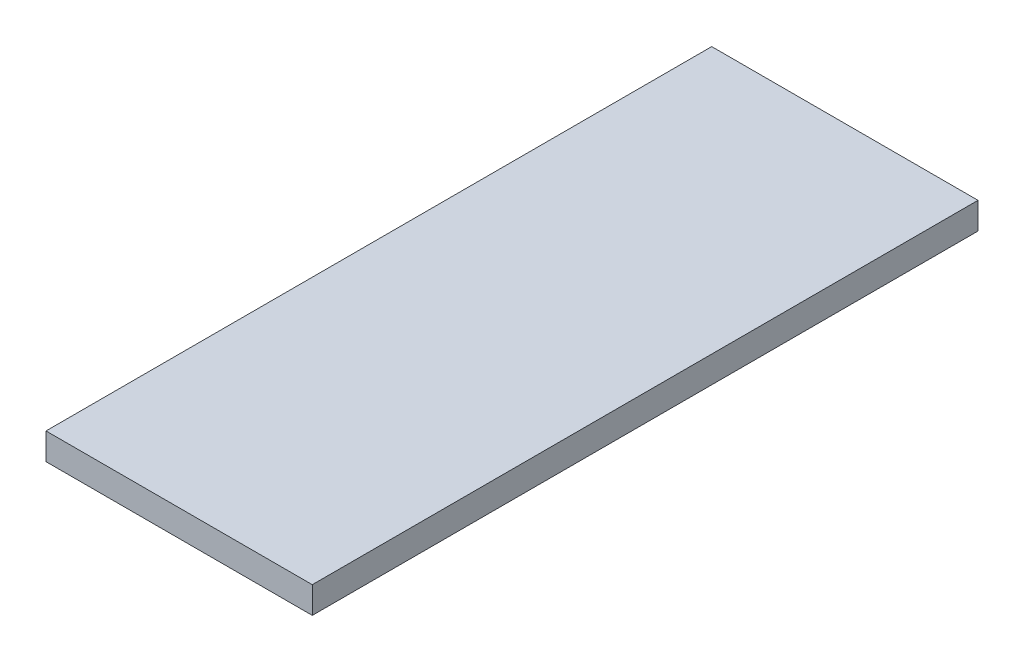
ISO-10303-21;
HEADER;
FILE_DESCRIPTION(('STEP AP214'),'2;1');
FILE_NAME('part.step','',(''),(''),'','','');
FILE_SCHEMA(('AUTOMOTIVE_DESIGN { 1 0 10303 214 1 1 1 1 }'));
ENDSEC;
DATA;
#1=APPLICATION_CONTEXT('core data for automotive mechanical design processes');
#2=APPLICATION_PROTOCOL_DEFINITION('international standard','automotive_design',2000,#1);
#3=PRODUCT_CONTEXT('',#1,'mechanical');
#4=PRODUCT('Part','Part','',(#3));
#5=PRODUCT_RELATED_PRODUCT_CATEGORY('part','',(#4));
#6=PRODUCT_DEFINITION_FORMATION('','',#4);
#7=PRODUCT_DEFINITION_CONTEXT('part definition',#1,'design');
#8=PRODUCT_DEFINITION('design','',#6,#7);
#9=PRODUCT_DEFINITION_SHAPE('','',#8);
#10=(LENGTH_UNIT() NAMED_UNIT(*) SI_UNIT(.MILLI.,.METRE.));
#11=(NAMED_UNIT(*) PLANE_ANGLE_UNIT() SI_UNIT($,.RADIAN.));
#12=(NAMED_UNIT(*) SI_UNIT($,.STERADIAN.) SOLID_ANGLE_UNIT());
#13=UNCERTAINTY_MEASURE_WITH_UNIT(LENGTH_MEASURE(1.E-05),#10,'distance_accuracy_value','');
#14=(GEOMETRIC_REPRESENTATION_CONTEXT(3) GLOBAL_UNCERTAINTY_ASSIGNED_CONTEXT((#13)) GLOBAL_UNIT_ASSIGNED_CONTEXT((#10,
#11,#12)) REPRESENTATION_CONTEXT('',''));
#15=CARTESIAN_POINT('',(0.,0.,0.));
#16=DIRECTION('',(0.,0.,1.));
#17=DIRECTION('',(1.,0.,0.));
#18=AXIS2_PLACEMENT_3D('',#15,#16,#17);
#19=CARTESIAN_POINT('',(0.,4.,0.));
#20=DIRECTION('',(1.,0.,0.));
#21=DIRECTION('',(0.,0.,-1.));
#22=AXIS2_PLACEMENT_3D('',#19,#20,#21);
#23=PLANE('',#22);
#24=DIRECTION('',(0.,0.,1.));
#25=VECTOR('',#24,1.);
#26=CARTESIAN_POINT('',(0.,0.,0.));
#27=LINE('',#26,#25);
#28=CARTESIAN_POINT('',(0.,0.,0.));
#29=VERTEX_POINT('',#28);
#30=CARTESIAN_POINT('',(0.,0.,100.));
#31=VERTEX_POINT('',#30);
#32=EDGE_CURVE('E107',#29,#31,#27,.T.);
#33=ORIENTED_EDGE('',*,*,#32,.T.);
#34=DIRECTION('',(0.,-1.,0.));
#35=VECTOR('',#34,1.);
#36=CARTESIAN_POINT('',(0.,4.,100.));
#37=LINE('',#36,#35);
#38=CARTESIAN_POINT('',(0.,4.,100.));
#39=VERTEX_POINT('',#38);
#40=EDGE_CURVE('E11',#39,#31,#37,.T.);
#41=ORIENTED_EDGE('',*,*,#40,.F.);
#42=DIRECTION('',(0.,0.,1.));
#43=VECTOR('',#42,1.);
#44=CARTESIAN_POINT('',(0.,4.,0.));
#45=LINE('',#44,#43);
#46=CARTESIAN_POINT('',(0.,4.,0.));
#47=VERTEX_POINT('',#46);
#48=EDGE_CURVE('E91',#47,#39,#45,.T.);
#49=ORIENTED_EDGE('',*,*,#48,.F.);
#50=DIRECTION('',(0.,-1.,0.));
#51=VECTOR('',#50,1.);
#52=CARTESIAN_POINT('',(0.,4.,0.));
#53=LINE('',#52,#51);
#54=EDGE_CURVE('E103',#47,#29,#53,.T.);
#55=ORIENTED_EDGE('',*,*,#54,.T.);
#56=EDGE_LOOP('',(#33,#41,#49,#55));
#57=FACE_BOUND('',#56,.T.);
#58=ADVANCED_FACE('F39',(#57),#23,.F.);
#59=CARTESIAN_POINT('',(0.,4.,100.));
#60=DIRECTION('',(0.,0.,-1.));
#61=DIRECTION('',(-1.,0.,0.));
#62=AXIS2_PLACEMENT_3D('',#59,#60,#61);
#63=PLANE('',#62);
#64=DIRECTION('',(1.,0.,0.));
#65=VECTOR('',#64,1.);
#66=CARTESIAN_POINT('',(0.,0.,100.));
#67=LINE('',#66,#65);
#68=CARTESIAN_POINT('',(40.,0.,100.));
#69=VERTEX_POINT('',#68);
#70=EDGE_CURVE('E96',#31,#69,#67,.T.);
#71=ORIENTED_EDGE('',*,*,#70,.T.);
#72=DIRECTION('',(0.,-1.,0.));
#73=VECTOR('',#72,1.);
#74=CARTESIAN_POINT('',(40.,4.,100.));
#75=LINE('',#74,#73);
#76=CARTESIAN_POINT('',(40.,4.,100.));
#77=VERTEX_POINT('',#76);
#78=EDGE_CURVE('E48',#77,#69,#75,.T.);
#79=ORIENTED_EDGE('',*,*,#78,.F.);
#80=DIRECTION('',(1.,0.,0.));
#81=VECTOR('',#80,1.);
#82=CARTESIAN_POINT('',(0.,4.,100.));
#83=LINE('',#82,#81);
#84=EDGE_CURVE('E86',#39,#77,#83,.T.);
#85=ORIENTED_EDGE('',*,*,#84,.F.);
#86=ORIENTED_EDGE('',*,*,#40,.T.);
#87=EDGE_LOOP('',(#71,#79,#85,#86));
#88=FACE_BOUND('',#87,.T.);
#89=ADVANCED_FACE('F95',(#88),#63,.F.);
#90=CARTESIAN_POINT('',(40.,4.,0.));
#91=DIRECTION('',(-1.,0.,0.));
#92=DIRECTION('',(0.,0.,1.));
#93=AXIS2_PLACEMENT_3D('',#90,#91,#92);
#94=PLANE('',#93);
#95=DIRECTION('',(0.,0.,-1.));
#96=VECTOR('',#95,1.);
#97=CARTESIAN_POINT('',(40.,0.,0.));
#98=LINE('',#97,#96);
#99=CARTESIAN_POINT('',(40.,0.,0.));
#100=VERTEX_POINT('',#99);
#101=EDGE_CURVE('E73',#69,#100,#98,.T.);
#102=ORIENTED_EDGE('',*,*,#101,.T.);
#103=DIRECTION('',(0.,-1.,0.));
#104=VECTOR('',#103,1.);
#105=CARTESIAN_POINT('',(40.,4.,0.));
#106=LINE('',#105,#104);
#107=CARTESIAN_POINT('',(40.,4.,0.));
#108=VERTEX_POINT('',#107);
#109=EDGE_CURVE('E98',#108,#100,#106,.T.);
#110=ORIENTED_EDGE('',*,*,#109,.F.);
#111=DIRECTION('',(0.,0.,-1.));
#112=VECTOR('',#111,1.);
#113=CARTESIAN_POINT('',(40.,4.,0.));
#114=LINE('',#113,#112);
#115=EDGE_CURVE('E89',#77,#108,#114,.T.);
#116=ORIENTED_EDGE('',*,*,#115,.F.);
#117=ORIENTED_EDGE('',*,*,#78,.T.);
#118=EDGE_LOOP('',(#102,#110,#116,#117));
#119=FACE_BOUND('',#118,.T.);
#120=ADVANCED_FACE('F99',(#119),#94,.F.);
#121=CARTESIAN_POINT('',(0.,4.,0.));
#122=DIRECTION('',(0.,0.,1.));
#123=DIRECTION('',(1.,0.,0.));
#124=AXIS2_PLACEMENT_3D('',#121,#122,#123);
#125=PLANE('',#124);
#126=DIRECTION('',(-1.,0.,0.));
#127=VECTOR('',#126,1.);
#128=CARTESIAN_POINT('',(0.,0.,0.));
#129=LINE('',#128,#127);
#130=EDGE_CURVE('E79',#100,#29,#129,.T.);
#131=ORIENTED_EDGE('',*,*,#130,.T.);
#132=ORIENTED_EDGE('',*,*,#54,.F.);
#133=DIRECTION('',(-1.,0.,0.));
#134=VECTOR('',#133,1.);
#135=CARTESIAN_POINT('',(0.,4.,0.));
#136=LINE('',#135,#134);
#137=EDGE_CURVE('E56',#108,#47,#136,.T.);
#138=ORIENTED_EDGE('',*,*,#137,.F.);
#139=ORIENTED_EDGE('',*,*,#109,.T.);
#140=EDGE_LOOP('',(#131,#132,#138,#139));
#141=FACE_BOUND('',#140,.T.);
#142=ADVANCED_FACE('F120',(#141),#125,.F.);
#143=CARTESIAN_POINT('',(0.,4.,0.));
#144=DIRECTION('',(0.,1.,0.));
#145=DIRECTION('',(0.,0.,1.));
#146=AXIS2_PLACEMENT_3D('',#143,#144,#145);
#147=PLANE('',#146);
#148=ORIENTED_EDGE('',*,*,#48,.T.);
#149=ORIENTED_EDGE('',*,*,#84,.T.);
#150=ORIENTED_EDGE('',*,*,#115,.T.);
#151=ORIENTED_EDGE('',*,*,#137,.T.);
#152=EDGE_LOOP('',(#148,#149,#150,#151));
#153=FACE_BOUND('',#152,.T.);
#154=ADVANCED_FACE('F87',(#153),#147,.T.);
#155=CARTESIAN_POINT('',(0.,0.,0.));
#156=DIRECTION('',(0.,1.,0.));
#157=DIRECTION('',(0.,0.,1.));
#158=AXIS2_PLACEMENT_3D('',#155,#156,#157);
#159=PLANE('',#158);
#160=ORIENTED_EDGE('',*,*,#32,.F.);
#161=ORIENTED_EDGE('',*,*,#130,.F.);
#162=ORIENTED_EDGE('',*,*,#101,.F.);
#163=ORIENTED_EDGE('',*,*,#70,.F.);
#164=EDGE_LOOP('',(#160,#161,#162,#163));
#165=FACE_BOUND('',#164,.T.);
#166=ADVANCED_FACE('F123',(#165),#159,.F.);
#167=CLOSED_SHELL('',(#58,#89,#120,#142,#154,#166));
#168=MANIFOLD_SOLID_BREP('B2',#167);
#169=ADVANCED_BREP_SHAPE_REPRESENTATION('',(#18,#168),#14);
#170=SHAPE_DEFINITION_REPRESENTATION(#9,#169);
ENDSEC;
END-ISO-10303-21;
